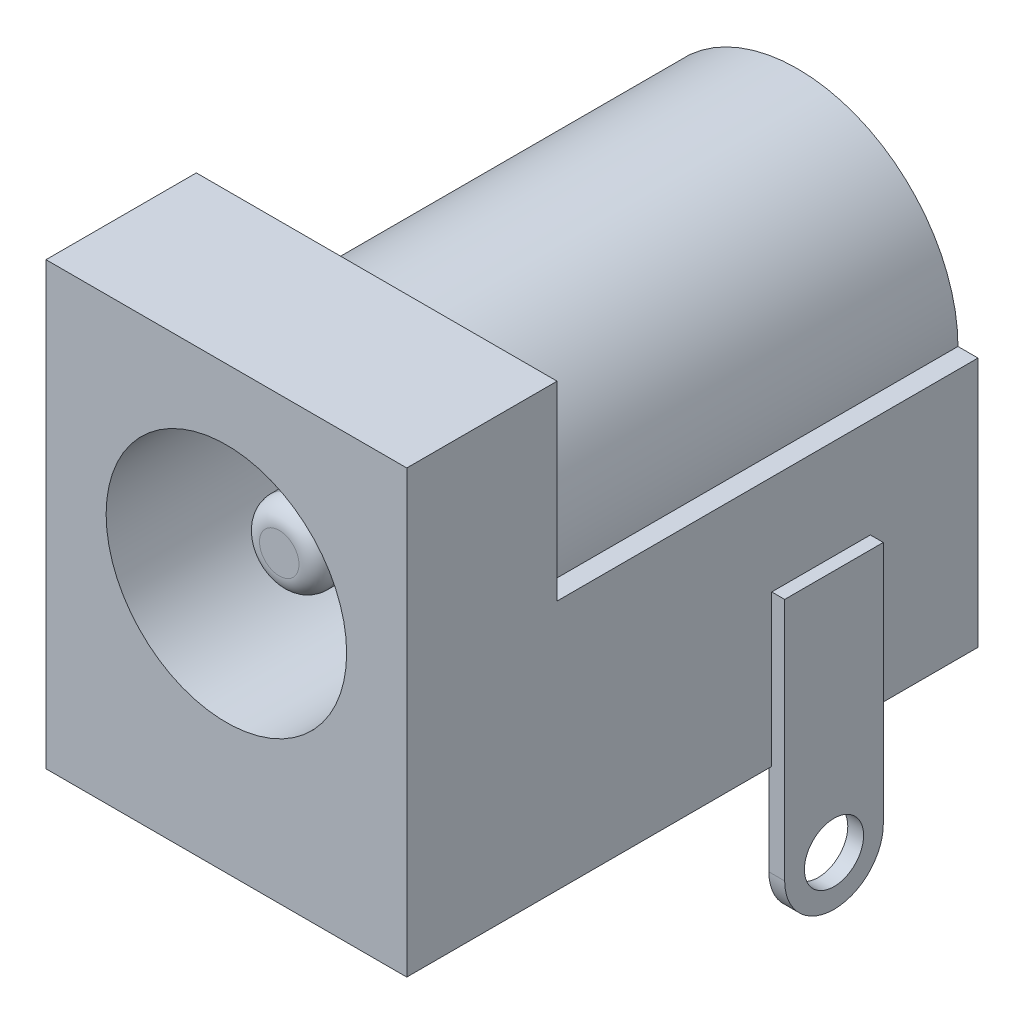
ISO-10303-21;
HEADER;
FILE_DESCRIPTION(('STEP AP214'),'2;1');
FILE_NAME('part.step','',(''),(''),'','','');
FILE_SCHEMA(('AUTOMOTIVE_DESIGN { 1 0 10303 214 1 1 1 1 }'));
ENDSEC;
DATA;
#1=APPLICATION_CONTEXT('core data for automotive mechanical design processes');
#2=APPLICATION_PROTOCOL_DEFINITION('international standard','automotive_design',2000,#1);
#3=PRODUCT_CONTEXT('',#1,'mechanical');
#4=PRODUCT('Part','Part','',(#3));
#5=PRODUCT_RELATED_PRODUCT_CATEGORY('part','',(#4));
#6=PRODUCT_DEFINITION_FORMATION('','',#4);
#7=PRODUCT_DEFINITION_CONTEXT('part definition',#1,'design');
#8=PRODUCT_DEFINITION('design','',#6,#7);
#9=PRODUCT_DEFINITION_SHAPE('','',#8);
#10=(LENGTH_UNIT() NAMED_UNIT(*) SI_UNIT(.MILLI.,.METRE.));
#11=(NAMED_UNIT(*) PLANE_ANGLE_UNIT() SI_UNIT($,.RADIAN.));
#12=(NAMED_UNIT(*) SI_UNIT($,.STERADIAN.) SOLID_ANGLE_UNIT());
#13=UNCERTAINTY_MEASURE_WITH_UNIT(LENGTH_MEASURE(1.E-05),#10,'distance_accuracy_value','');
#14=(GEOMETRIC_REPRESENTATION_CONTEXT(3) GLOBAL_UNCERTAINTY_ASSIGNED_CONTEXT((#13)) GLOBAL_UNIT_ASSIGNED_CONTEXT((#10,
#11,#12)) REPRESENTATION_CONTEXT('',''));
#15=CARTESIAN_POINT('',(0.,0.,0.));
#16=DIRECTION('',(0.,0.,1.));
#17=DIRECTION('',(1.,0.,0.));
#18=AXIS2_PLACEMENT_3D('',#15,#16,#17);
#19=CARTESIAN_POINT('',(-4.572,0.,-3.81));
#20=DIRECTION('',(0.,-1.,0.));
#21=DIRECTION('',(1.,0.,0.));
#22=AXIS2_PLACEMENT_3D('',#19,#20,#21);
#23=PLANE('',#22);
#24=DIRECTION('',(-1.,0.,0.));
#25=VECTOR('',#24,1.);
#26=CARTESIAN_POINT('',(-1.1,0.,-7.65));
#27=LINE('',#26,#25);
#28=CARTESIAN_POINT('',(1.1,0.,-7.65));
#29=VERTEX_POINT('',#28);
#30=CARTESIAN_POINT('',(-1.1,0.,-7.65));
#31=VERTEX_POINT('',#30);
#32=EDGE_CURVE('E55',#29,#31,#27,.T.);
#33=ORIENTED_EDGE('',*,*,#32,.T.);
#34=DIRECTION('',(0.,0.,-1.));
#35=VECTOR('',#34,1.);
#36=CARTESIAN_POINT('',(-1.1,0.,-7.35));
#37=LINE('',#36,#35);
#38=CARTESIAN_POINT('',(-1.1,0.,-7.35));
#39=VERTEX_POINT('',#38);
#40=EDGE_CURVE('E241',#39,#31,#37,.T.);
#41=ORIENTED_EDGE('',*,*,#40,.F.);
#42=DIRECTION('',(-1.,0.,0.));
#43=VECTOR('',#42,1.);
#44=CARTESIAN_POINT('',(-1.1,0.,-7.35));
#45=LINE('',#44,#43);
#46=CARTESIAN_POINT('',(1.1,0.,-7.35));
#47=VERTEX_POINT('',#46);
#48=EDGE_CURVE('E216',#47,#39,#45,.T.);
#49=ORIENTED_EDGE('',*,*,#48,.F.);
#50=DIRECTION('',(0.,0.,-1.));
#51=VECTOR('',#50,1.);
#52=CARTESIAN_POINT('',(1.1,0.,-7.35));
#53=LINE('',#52,#51);
#54=EDGE_CURVE('E226',#47,#29,#53,.T.);
#55=ORIENTED_EDGE('',*,*,#54,.T.);
#56=EDGE_LOOP('',(#33,#41,#49,#55));
#57=FACE_BOUND('',#56,.T.);
#58=DIRECTION('',(0.,0.,-1.));
#59=VECTOR('',#58,1.);
#60=CARTESIAN_POINT('',(4.5,0.,-3.81));
#61=LINE('',#60,#59);
#62=CARTESIAN_POINT('',(4.5,0.,-9.2499999999999));
#63=VERTEX_POINT('',#62);
#64=CARTESIAN_POINT('',(4.5,0.,-11.7499999999999));
#65=VERTEX_POINT('',#64);
#66=EDGE_CURVE('E348',#63,#65,#61,.T.);
#67=ORIENTED_EDGE('',*,*,#66,.F.);
#68=DIRECTION('',(1.,0.,0.));
#69=VECTOR('',#68,1.);
#70=CARTESIAN_POINT('',(-4.572,0.,-9.2499999999999));
#71=LINE('',#70,#69);
#72=CARTESIAN_POINT('',(4.572,0.,-9.2499999999999));
#73=VERTEX_POINT('',#72);
#74=EDGE_CURVE('E40',#63,#73,#71,.T.);
#75=ORIENTED_EDGE('',*,*,#74,.T.);
#76=DIRECTION('',(0.,0.,1.));
#77=VECTOR('',#76,1.);
#78=CARTESIAN_POINT('',(4.572,0.,-3.81));
#79=LINE('',#78,#77);
#80=CARTESIAN_POINT('',(4.572,0.,0.));
#81=VERTEX_POINT('',#80);
#82=EDGE_CURVE('E355',#73,#81,#79,.T.);
#83=ORIENTED_EDGE('',*,*,#82,.T.);
#84=DIRECTION('',(1.,0.,0.));
#85=VECTOR('',#84,1.);
#86=CARTESIAN_POINT('',(-4.572,0.,0.));
#87=LINE('',#86,#85);
#88=CARTESIAN_POINT('',(-4.572,0.,0.));
#89=VERTEX_POINT('',#88);
#90=EDGE_CURVE('E385',#89,#81,#87,.T.);
#91=ORIENTED_EDGE('',*,*,#90,.F.);
#92=DIRECTION('',(0.,0.,1.));
#93=VECTOR('',#92,1.);
#94=CARTESIAN_POINT('',(-4.572,0.,-3.81));
#95=LINE('',#94,#93);
#96=CARTESIAN_POINT('',(-4.572,0.,-14.478));
#97=VERTEX_POINT('',#96);
#98=EDGE_CURVE('E365',#97,#89,#95,.T.);
#99=ORIENTED_EDGE('',*,*,#98,.F.);
#100=DIRECTION('',(-1.,0.,0.));
#101=VECTOR('',#100,1.);
#102=CARTESIAN_POINT('',(-4.572,0.,-14.478));
#103=LINE('',#102,#101);
#104=CARTESIAN_POINT('',(4.572,0.,-14.478));
#105=VERTEX_POINT('',#104);
#106=EDGE_CURVE('E302',#105,#97,#103,.T.);
#107=ORIENTED_EDGE('',*,*,#106,.F.);
#108=CARTESIAN_POINT('',(4.572,0.,-11.7499999999999));
#109=VERTEX_POINT('',#108);
#110=EDGE_CURVE('E364',#105,#109,#79,.T.);
#111=ORIENTED_EDGE('',*,*,#110,.T.);
#112=DIRECTION('',(-1.,0.,0.));
#113=VECTOR('',#112,1.);
#114=CARTESIAN_POINT('',(-4.572,0.,-11.7499999999999));
#115=LINE('',#114,#113);
#116=EDGE_CURVE('E345',#109,#65,#115,.T.);
#117=ORIENTED_EDGE('',*,*,#116,.T.);
#118=EDGE_LOOP('',(#67,#75,#83,#91,#99,#107,#111,#117));
#119=FACE_BOUND('',#118,.T.);
#120=DIRECTION('',(-1.,0.,0.));
#121=VECTOR('',#120,1.);
#122=CARTESIAN_POINT('',(1.425,0.,-13.9));
#123=LINE('',#122,#121);
#124=CARTESIAN_POINT('',(1.425,0.,-13.9));
#125=VERTEX_POINT('',#124);
#126=CARTESIAN_POINT('',(-1.425,0.,-13.9));
#127=VERTEX_POINT('',#126);
#128=EDGE_CURVE('E47',#125,#127,#123,.T.);
#129=ORIENTED_EDGE('',*,*,#128,.T.);
#130=DIRECTION('',(0.,0.,-1.));
#131=VECTOR('',#130,1.);
#132=CARTESIAN_POINT('',(-1.425,0.,-13.5));
#133=LINE('',#132,#131);
#134=CARTESIAN_POINT('',(-1.425,0.,-13.5));
#135=VERTEX_POINT('',#134);
#136=EDGE_CURVE('E187',#135,#127,#133,.T.);
#137=ORIENTED_EDGE('',*,*,#136,.F.);
#138=DIRECTION('',(-1.,0.,0.));
#139=VECTOR('',#138,1.);
#140=CARTESIAN_POINT('',(1.425,0.,-13.5));
#141=LINE('',#140,#139);
#142=CARTESIAN_POINT('',(1.425,0.,-13.5));
#143=VERTEX_POINT('',#142);
#144=EDGE_CURVE('E193',#143,#135,#141,.T.);
#145=ORIENTED_EDGE('',*,*,#144,.F.);
#146=DIRECTION('',(0.,0.,-1.));
#147=VECTOR('',#146,1.);
#148=CARTESIAN_POINT('',(1.425,0.,-13.5));
#149=LINE('',#148,#147);
#150=EDGE_CURVE('E694',#143,#125,#149,.T.);
#151=ORIENTED_EDGE('',*,*,#150,.T.);
#152=EDGE_LOOP('',(#129,#137,#145,#151));
#153=FACE_BOUND('',#152,.T.);
#154=ADVANCED_FACE('F32',(#57,#119,#153),#23,.T.);
#155=CARTESIAN_POINT('',(4.572,0.,-3.81));
#156=DIRECTION('',(1.,0.,0.));
#157=DIRECTION('',(0.,0.,-1.));
#158=AXIS2_PLACEMENT_3D('',#155,#156,#157);
#159=PLANE('',#158);
#160=ORIENTED_EDGE('',*,*,#82,.F.);
#161=DIRECTION('',(0.,1.,0.));
#162=VECTOR('',#161,1.);
#163=CARTESIAN_POINT('',(4.572,0.,-9.2499999999999));
#164=LINE('',#163,#162);
#165=CARTESIAN_POINT('',(4.572,3.8299999999999,-9.2499999999999));
#166=VERTEX_POINT('',#165);
#167=EDGE_CURVE('E280',#73,#166,#164,.T.);
#168=ORIENTED_EDGE('',*,*,#167,.T.);
#169=DIRECTION('',(0.,0.,-1.));
#170=VECTOR('',#169,1.);
#171=CARTESIAN_POINT('',(4.572,3.8299999999999,-3.81));
#172=LINE('',#171,#170);
#173=CARTESIAN_POINT('',(4.572,3.8299999999999,-11.7499999999999));
#174=VERTEX_POINT('',#173);
#175=EDGE_CURVE('E12',#166,#174,#172,.T.);
#176=ORIENTED_EDGE('',*,*,#175,.T.);
#177=DIRECTION('',(0.,-1.,0.));
#178=VECTOR('',#177,1.);
#179=CARTESIAN_POINT('',(4.572,0.,-11.7499999999999));
#180=LINE('',#179,#178);
#181=EDGE_CURVE('E277',#174,#109,#180,.T.);
#182=ORIENTED_EDGE('',*,*,#181,.T.);
#183=ORIENTED_EDGE('',*,*,#110,.F.);
#184=DIRECTION('',(0.,-1.,0.));
#185=VECTOR('',#184,1.);
#186=CARTESIAN_POINT('',(4.572,0.,-14.478));
#187=LINE('',#186,#185);
#188=CARTESIAN_POINT('',(4.57200000000001,6.34999999999998,-14.478));
#189=VERTEX_POINT('',#188);
#190=EDGE_CURVE('E299',#189,#105,#187,.T.);
#191=ORIENTED_EDGE('',*,*,#190,.F.);
#192=DIRECTION('',(0.,0.,1.));
#193=VECTOR('',#192,1.);
#194=CARTESIAN_POINT('',(4.57200000000001,6.34999999999998,-14.478));
#195=LINE('',#194,#193);
#196=CARTESIAN_POINT('',(4.57200000000001,6.34999999999998,-3.81));
#197=VERTEX_POINT('',#196);
#198=EDGE_CURVE('E323',#189,#197,#195,.T.);
#199=ORIENTED_EDGE('',*,*,#198,.T.);
#200=DIRECTION('',(0.,1.,0.));
#201=VECTOR('',#200,1.);
#202=CARTESIAN_POINT('',(4.572,0.,-3.81));
#203=LINE('',#202,#201);
#204=CARTESIAN_POINT('',(4.572,11.176,-3.81));
#205=VERTEX_POINT('',#204);
#206=EDGE_CURVE('E320',#197,#205,#203,.T.);
#207=ORIENTED_EDGE('',*,*,#206,.T.);
#208=DIRECTION('',(0.,0.,1.));
#209=VECTOR('',#208,1.);
#210=CARTESIAN_POINT('',(4.572,11.176,-3.81));
#211=LINE('',#210,#209);
#212=CARTESIAN_POINT('',(4.572,11.176,0.));
#213=VERTEX_POINT('',#212);
#214=EDGE_CURVE('E368',#205,#213,#211,.T.);
#215=ORIENTED_EDGE('',*,*,#214,.T.);
#216=DIRECTION('',(0.,1.,0.));
#217=VECTOR('',#216,1.);
#218=CARTESIAN_POINT('',(4.572,0.,0.));
#219=LINE('',#218,#217);
#220=EDGE_CURVE('E362',#81,#213,#219,.T.);
#221=ORIENTED_EDGE('',*,*,#220,.F.);
#222=EDGE_LOOP('',(#160,#168,#176,#182,#183,#191,#199,#207,#215,#221));
#223=FACE_BOUND('',#222,.T.);
#224=ADVANCED_FACE('F360',(#223),#159,.T.);
#225=CARTESIAN_POINT('',(0.,6.35,-9.144));
#226=DIRECTION('',(0.,0.,1.));
#227=DIRECTION('',(1.,0.,0.));
#228=AXIS2_PLACEMENT_3D('',#225,#226,#227);
#229=PLANE('',#228);
#230=CARTESIAN_POINT('',(0.,6.35,-9.144));
#231=DIRECTION('',(0.,0.,1.));
#232=DIRECTION('',(1.,0.,0.));
#233=AXIS2_PLACEMENT_3D('',#230,#231,#232);
#234=CIRCLE('',#233,3.048);
#235=CARTESIAN_POINT('',(3.048,6.35,-9.144));
#236=VERTEX_POINT('',#235);
#237=EDGE_CURVE('E287',#236,#236,#234,.T.);
#238=ORIENTED_EDGE('',*,*,#237,.T.);
#239=EDGE_LOOP('',(#238));
#240=FACE_BOUND('',#239,.T.);
#241=CARTESIAN_POINT('',(0.,6.35,-9.144));
#242=DIRECTION('',(0.,0.,1.));
#243=DIRECTION('',(1.,0.,0.));
#244=AXIS2_PLACEMENT_3D('',#241,#242,#243);
#245=CIRCLE('',#244,0.999999999999999);
#246=CARTESIAN_POINT('',(0.999999999999999,6.35,-9.144));
#247=VERTEX_POINT('',#246);
#248=EDGE_CURVE('E283',#247,#247,#245,.T.);
#249=ORIENTED_EDGE('',*,*,#248,.F.);
#250=EDGE_LOOP('',(#249));
#251=FACE_BOUND('',#250,.T.);
#252=ADVANCED_FACE('F407',(#240,#251),#229,.T.);
#253=CARTESIAN_POINT('',(-4.572,0.,-3.81));
#254=DIRECTION('',(-1.,0.,0.));
#255=DIRECTION('',(0.,-1.,0.));
#256=AXIS2_PLACEMENT_3D('',#253,#254,#255);
#257=PLANE('',#256);
#258=DIRECTION('',(0.,-1.,0.));
#259=VECTOR('',#258,1.);
#260=CARTESIAN_POINT('',(-4.572,0.,0.));
#261=LINE('',#260,#259);
#262=CARTESIAN_POINT('',(-4.572,11.176,0.));
#263=VERTEX_POINT('',#262);
#264=EDGE_CURVE('E382',#263,#89,#261,.T.);
#265=ORIENTED_EDGE('',*,*,#264,.F.);
#266=DIRECTION('',(0.,0.,1.));
#267=VECTOR('',#266,1.);
#268=CARTESIAN_POINT('',(-4.572,11.176,-3.81));
#269=LINE('',#268,#267);
#270=CARTESIAN_POINT('',(-4.572,11.176,-3.81));
#271=VERTEX_POINT('',#270);
#272=EDGE_CURVE('E342',#271,#263,#269,.T.);
#273=ORIENTED_EDGE('',*,*,#272,.F.);
#274=DIRECTION('',(0.,-1.,0.));
#275=VECTOR('',#274,1.);
#276=CARTESIAN_POINT('',(-4.572,0.,-3.81));
#277=LINE('',#276,#275);
#278=CARTESIAN_POINT('',(-4.572,6.34999999999998,-3.81));
#279=VERTEX_POINT('',#278);
#280=EDGE_CURVE('E373',#271,#279,#277,.T.);
#281=ORIENTED_EDGE('',*,*,#280,.T.);
#282=DIRECTION('',(0.,0.,1.));
#283=VECTOR('',#282,1.);
#284=CARTESIAN_POINT('',(-4.57200000000001,6.34999999999997,-14.478));
#285=LINE('',#284,#283);
#286=CARTESIAN_POINT('',(-4.57200000000001,6.34999999999997,-14.478));
#287=VERTEX_POINT('',#286);
#288=EDGE_CURVE('E327',#287,#279,#285,.T.);
#289=ORIENTED_EDGE('',*,*,#288,.F.);
#290=DIRECTION('',(0.,1.,0.));
#291=VECTOR('',#290,1.);
#292=CARTESIAN_POINT('',(-4.57200000000001,6.34999999999997,-14.478));
#293=LINE('',#292,#291);
#294=EDGE_CURVE('E305',#97,#287,#293,.T.);
#295=ORIENTED_EDGE('',*,*,#294,.F.);
#296=ORIENTED_EDGE('',*,*,#98,.T.);
#297=EDGE_LOOP('',(#265,#273,#281,#289,#295,#296));
#298=FACE_BOUND('',#297,.T.);
#299=ADVANCED_FACE('F399',(#298),#257,.T.);
#300=CARTESIAN_POINT('',(-4.572,11.176,-3.81));
#301=DIRECTION('',(0.,1.,0.));
#302=DIRECTION('',(-1.,0.,0.));
#303=AXIS2_PLACEMENT_3D('',#300,#301,#302);
#304=PLANE('',#303);
#305=DIRECTION('',(-1.,0.,0.));
#306=VECTOR('',#305,1.);
#307=CARTESIAN_POINT('',(-4.572,11.176,0.));
#308=LINE('',#307,#306);
#309=EDGE_CURVE('E376',#213,#263,#308,.T.);
#310=ORIENTED_EDGE('',*,*,#309,.F.);
#311=ORIENTED_EDGE('',*,*,#214,.F.);
#312=DIRECTION('',(-1.,0.,0.));
#313=VECTOR('',#312,1.);
#314=CARTESIAN_POINT('',(-4.572,11.176,-3.81));
#315=LINE('',#314,#313);
#316=EDGE_CURVE('E369',#205,#271,#315,.T.);
#317=ORIENTED_EDGE('',*,*,#316,.T.);
#318=ORIENTED_EDGE('',*,*,#272,.T.);
#319=EDGE_LOOP('',(#310,#311,#317,#318));
#320=FACE_BOUND('',#319,.T.);
#321=ADVANCED_FACE('F396',(#320),#304,.T.);
#322=CARTESIAN_POINT('',(-4.572,11.176,-3.81));
#323=DIRECTION('',(0.,0.,-1.));
#324=DIRECTION('',(-1.,0.,0.));
#325=AXIS2_PLACEMENT_3D('',#322,#323,#324);
#326=PLANE('',#325);
#327=DIRECTION('',(1.,0.,0.));
#328=VECTOR('',#327,1.);
#329=CARTESIAN_POINT('',(-4.064,6.35,-3.81));
#330=LINE('',#329,#328);
#331=CARTESIAN_POINT('',(-4.064,6.35,-3.81));
#332=VERTEX_POINT('',#331);
#333=EDGE_CURVE('E297',#279,#332,#330,.T.);
#334=ORIENTED_EDGE('',*,*,#333,.F.);
#335=ORIENTED_EDGE('',*,*,#280,.F.);
#336=ORIENTED_EDGE('',*,*,#316,.F.);
#337=ORIENTED_EDGE('',*,*,#206,.F.);
#338=DIRECTION('',(1.,0.,0.));
#339=VECTOR('',#338,1.);
#340=CARTESIAN_POINT('',(4.064,6.35,-3.81));
#341=LINE('',#340,#339);
#342=CARTESIAN_POINT('',(4.064,6.35,-3.81));
#343=VERTEX_POINT('',#342);
#344=EDGE_CURVE('E312',#343,#197,#341,.T.);
#345=ORIENTED_EDGE('',*,*,#344,.F.);
#346=CARTESIAN_POINT('',(0.,6.35,-3.81));
#347=DIRECTION('',(0.,0.,-1.));
#348=DIRECTION('',(1.,0.,0.));
#349=AXIS2_PLACEMENT_3D('',#346,#347,#348);
#350=CIRCLE('',#349,4.064);
#351=EDGE_CURVE('E290',#332,#343,#350,.T.);
#352=ORIENTED_EDGE('',*,*,#351,.F.);
#353=EDGE_LOOP('',(#334,#335,#336,#337,#345,#352));
#354=FACE_BOUND('',#353,.T.);
#355=ADVANCED_FACE('F398',(#354),#326,.T.);
#356=CARTESIAN_POINT('',(-4.572,11.176,0.));
#357=DIRECTION('',(0.,0.,-1.));
#358=DIRECTION('',(-1.,0.,0.));
#359=AXIS2_PLACEMENT_3D('',#356,#357,#358);
#360=PLANE('',#359);
#361=CARTESIAN_POINT('',(0.,6.35,0.));
#362=DIRECTION('',(0.,0.,1.));
#363=DIRECTION('',(1.,0.,0.));
#364=AXIS2_PLACEMENT_3D('',#361,#362,#363);
#365=CIRCLE('',#364,3.048);
#366=CARTESIAN_POINT('',(3.048,6.35,0.));
#367=VERTEX_POINT('',#366);
#368=EDGE_CURVE('E286',#367,#367,#365,.T.);
#369=ORIENTED_EDGE('',*,*,#368,.F.);
#370=EDGE_LOOP('',(#369));
#371=FACE_BOUND('',#370,.T.);
#372=ORIENTED_EDGE('',*,*,#264,.T.);
#373=ORIENTED_EDGE('',*,*,#90,.T.);
#374=ORIENTED_EDGE('',*,*,#220,.T.);
#375=ORIENTED_EDGE('',*,*,#309,.T.);
#376=EDGE_LOOP('',(#372,#373,#374,#375));
#377=FACE_BOUND('',#376,.T.);
#378=ADVANCED_FACE('F395',(#371,#377),#360,.F.);
#379=CARTESIAN_POINT('',(0.,6.35,-14.478));
#380=DIRECTION('',(0.,0.,1.));
#381=DIRECTION('',(1.,0.,0.));
#382=AXIS2_PLACEMENT_3D('',#379,#380,#381);
#383=CYLINDRICAL_SURFACE('',#382,4.064);
#384=ORIENTED_EDGE('',*,*,#351,.T.);
#385=DIRECTION('',(0.,0.,1.));
#386=VECTOR('',#385,1.);
#387=CARTESIAN_POINT('',(4.064,6.35,-14.478));
#388=LINE('',#387,#386);
#389=CARTESIAN_POINT('',(4.064,6.35,-14.478));
#390=VERTEX_POINT('',#389);
#391=EDGE_CURVE('E326',#390,#343,#388,.T.);
#392=ORIENTED_EDGE('',*,*,#391,.F.);
#393=CARTESIAN_POINT('',(0.,6.35,-14.478));
#394=DIRECTION('',(0.,0.,-1.));
#395=DIRECTION('',(1.,0.,0.));
#396=AXIS2_PLACEMENT_3D('',#393,#394,#395);
#397=CIRCLE('',#396,4.064);
#398=CARTESIAN_POINT('',(-4.064,6.35,-14.478));
#399=VERTEX_POINT('',#398);
#400=EDGE_CURVE('E293',#399,#390,#397,.T.);
#401=ORIENTED_EDGE('',*,*,#400,.F.);
#402=DIRECTION('',(0.,0.,1.));
#403=VECTOR('',#402,1.);
#404=CARTESIAN_POINT('',(-4.064,6.35,-14.478));
#405=LINE('',#404,#403);
#406=EDGE_CURVE('E309',#399,#332,#405,.T.);
#407=ORIENTED_EDGE('',*,*,#406,.T.);
#408=EDGE_LOOP('',(#384,#392,#401,#407));
#409=FACE_BOUND('',#408,.T.);
#410=ADVANCED_FACE('F509',(#409),#383,.T.);
#411=CARTESIAN_POINT('',(4.064,6.35,-14.478));
#412=DIRECTION('',(0.,-1.,0.));
#413=DIRECTION('',(1.,0.,0.));
#414=AXIS2_PLACEMENT_3D('',#411,#412,#413);
#415=PLANE('',#414);
#416=ORIENTED_EDGE('',*,*,#344,.T.);
#417=ORIENTED_EDGE('',*,*,#198,.F.);
#418=DIRECTION('',(1.,0.,0.));
#419=VECTOR('',#418,1.);
#420=CARTESIAN_POINT('',(4.064,6.35,-14.478));
#421=LINE('',#420,#419);
#422=EDGE_CURVE('E296',#390,#189,#421,.T.);
#423=ORIENTED_EDGE('',*,*,#422,.F.);
#424=ORIENTED_EDGE('',*,*,#391,.T.);
#425=EDGE_LOOP('',(#416,#417,#423,#424));
#426=FACE_BOUND('',#425,.T.);
#427=ADVANCED_FACE('F505',(#426),#415,.F.);
#428=CARTESIAN_POINT('',(-4.064,6.35,-14.478));
#429=DIRECTION('',(0.,-1.,0.));
#430=DIRECTION('',(1.,0.,0.));
#431=AXIS2_PLACEMENT_3D('',#428,#429,#430);
#432=PLANE('',#431);
#433=ORIENTED_EDGE('',*,*,#333,.T.);
#434=ORIENTED_EDGE('',*,*,#406,.F.);
#435=DIRECTION('',(1.,0.,0.));
#436=VECTOR('',#435,1.);
#437=CARTESIAN_POINT('',(-4.064,6.35,-14.478));
#438=LINE('',#437,#436);
#439=EDGE_CURVE('E307',#287,#399,#438,.T.);
#440=ORIENTED_EDGE('',*,*,#439,.F.);
#441=ORIENTED_EDGE('',*,*,#288,.T.);
#442=EDGE_LOOP('',(#433,#434,#440,#441));
#443=FACE_BOUND('',#442,.T.);
#444=ADVANCED_FACE('F501',(#443),#432,.F.);
#445=CARTESIAN_POINT('',(0.,6.35,-14.478));
#446=DIRECTION('',(0.,0.,1.));
#447=DIRECTION('',(1.,0.,0.));
#448=AXIS2_PLACEMENT_3D('',#445,#446,#447);
#449=PLANE('',#448);
#450=ORIENTED_EDGE('',*,*,#400,.T.);
#451=ORIENTED_EDGE('',*,*,#422,.T.);
#452=ORIENTED_EDGE('',*,*,#190,.T.);
#453=ORIENTED_EDGE('',*,*,#106,.T.);
#454=ORIENTED_EDGE('',*,*,#294,.T.);
#455=ORIENTED_EDGE('',*,*,#439,.T.);
#456=EDGE_LOOP('',(#450,#451,#452,#453,#454,#455));
#457=FACE_BOUND('',#456,.T.);
#458=ADVANCED_FACE('F497',(#457),#449,.F.);
#459=CARTESIAN_POINT('',(0.,6.35,-9.144));
#460=DIRECTION('',(0.,0.,1.));
#461=DIRECTION('',(1.,0.,0.));
#462=AXIS2_PLACEMENT_3D('',#459,#460,#461);
#463=CYLINDRICAL_SURFACE('',#462,3.048);
#464=ORIENTED_EDGE('',*,*,#237,.F.);
#465=EDGE_LOOP('',(#464));
#466=FACE_BOUND('',#465,.T.);
#467=ORIENTED_EDGE('',*,*,#368,.T.);
#468=EDGE_LOOP('',(#467));
#469=FACE_BOUND('',#468,.T.);
#470=ADVANCED_FACE('F490',(#466,#469),#463,.F.);
#471=CARTESIAN_POINT('',(0.,6.35,2.82842712474619));
#472=DIRECTION('',(0.,0.,-1.));
#473=DIRECTION('',(-1.,0.,0.));
#474=AXIS2_PLACEMENT_3D('',#471,#472,#473);
#475=CYLINDRICAL_SURFACE('',#474,0.999999999999999);
#476=CARTESIAN_POINT('',(0.,6.35,-1.84));
#477=DIRECTION('',(0.,0.,-1.));
#478=DIRECTION('',(-1.,0.,0.));
#479=AXIS2_PLACEMENT_3D('',#476,#477,#478);
#480=CIRCLE('',#479,0.999999999999999);
#481=CARTESIAN_POINT('',(-0.999999999999999,6.35,-1.84));
#482=VERTEX_POINT('',#481);
#483=EDGE_CURVE('E338',#482,#482,#480,.T.);
#484=ORIENTED_EDGE('',*,*,#483,.T.);
#485=EDGE_LOOP('',(#484));
#486=FACE_BOUND('',#485,.T.);
#487=ORIENTED_EDGE('',*,*,#248,.T.);
#488=EDGE_LOOP('',(#487));
#489=FACE_BOUND('',#488,.T.);
#490=ADVANCED_FACE('F486',(#486,#489),#475,.T.);
#491=CARTESIAN_POINT('',(-4.572,11.176,-1.34));
#492=DIRECTION('',(0.,0.,-1.));
#493=DIRECTION('',(-1.,0.,0.));
#494=AXIS2_PLACEMENT_3D('',#491,#492,#493);
#495=PLANE('',#494);
#496=CARTESIAN_POINT('',(0.,6.35,-1.34));
#497=DIRECTION('',(0.,0.,-1.));
#498=DIRECTION('',(-1.,0.,0.));
#499=AXIS2_PLACEMENT_3D('',#496,#497,#498);
#500=CIRCLE('',#499,0.499999999999999);
#501=CARTESIAN_POINT('',(-0.499999999999999,6.35,-1.34));
#502=VERTEX_POINT('',#501);
#503=EDGE_CURVE('E341',#502,#502,#500,.F.);
#504=ORIENTED_EDGE('',*,*,#503,.T.);
#505=EDGE_LOOP('',(#504));
#506=FACE_BOUND('',#505,.T.);
#507=ADVANCED_FACE('F483',(#506),#495,.F.);
#508=CARTESIAN_POINT('',(0.,6.35,-1.84));
#509=DIRECTION('',(0.,0.,-1.));
#510=DIRECTION('',(-1.,0.,0.));
#511=AXIS2_PLACEMENT_3D('',#508,#509,#510);
#512=DEGENERATE_TOROIDAL_SURFACE('',#511,0.499999999999999,0.5,.T.);
#513=ORIENTED_EDGE('',*,*,#503,.F.);
#514=EDGE_LOOP('',(#513));
#515=FACE_BOUND('',#514,.T.);
#516=ORIENTED_EDGE('',*,*,#483,.F.);
#517=EDGE_LOOP('',(#516));
#518=FACE_BOUND('',#517,.T.);
#519=ADVANCED_FACE('F34',(#515,#518),#512,.T.);
#520=CARTESIAN_POINT('',(4.9,-2.35000000000015,-10.4999999999999));
#521=DIRECTION('',(-1.,0.,0.));
#522=DIRECTION('',(0.,0.,1.));
#523=AXIS2_PLACEMENT_3D('',#520,#521,#522);
#524=PLANE('',#523);
#525=DIRECTION('',(0.,0.,1.));
#526=VECTOR('',#525,1.);
#527=CARTESIAN_POINT('',(4.9,3.8299999999999,-9.2499999999999));
#528=LINE('',#527,#526);
#529=CARTESIAN_POINT('',(4.9,3.8299999999999,-11.7499999999999));
#530=VERTEX_POINT('',#529);
#531=CARTESIAN_POINT('',(4.9,3.8299999999999,-9.2499999999999));
#532=VERTEX_POINT('',#531);
#533=EDGE_CURVE('E251',#530,#532,#528,.T.);
#534=ORIENTED_EDGE('',*,*,#533,.T.);
#535=DIRECTION('',(0.,-1.,0.));
#536=VECTOR('',#535,1.);
#537=CARTESIAN_POINT('',(4.9,3.8299999999999,-9.2499999999999));
#538=LINE('',#537,#536);
#539=CARTESIAN_POINT('',(4.9,-2.35000000000015,-9.2499999999999));
#540=VERTEX_POINT('',#539);
#541=EDGE_CURVE('E254',#532,#540,#538,.T.);
#542=ORIENTED_EDGE('',*,*,#541,.T.);
#543=CARTESIAN_POINT('',(4.9,-2.35000000000015,-10.4999999999999));
#544=DIRECTION('',(1.,0.,0.));
#545=DIRECTION('',(0.,0.,1.));
#546=AXIS2_PLACEMENT_3D('',#543,#544,#545);
#547=CIRCLE('',#546,1.25);
#548=CARTESIAN_POINT('',(4.9,-2.35000000000015,-11.7499999999999));
#549=VERTEX_POINT('',#548);
#550=EDGE_CURVE('E257',#540,#549,#547,.T.);
#551=ORIENTED_EDGE('',*,*,#550,.T.);
#552=DIRECTION('',(0.,1.,0.));
#553=VECTOR('',#552,1.);
#554=CARTESIAN_POINT('',(4.9,3.8299999999999,-11.7499999999999));
#555=LINE('',#554,#553);
#556=EDGE_CURVE('E259',#549,#530,#555,.T.);
#557=ORIENTED_EDGE('',*,*,#556,.T.);
#558=EDGE_LOOP('',(#534,#542,#551,#557));
#559=FACE_BOUND('',#558,.T.);
#560=CARTESIAN_POINT('',(4.9,-2.35000000000015,-10.4999999999999));
#561=DIRECTION('',(1.,0.,0.));
#562=DIRECTION('',(0.,0.,-1.));
#563=AXIS2_PLACEMENT_3D('',#560,#561,#562);
#564=CIRCLE('',#563,0.75);
#565=CARTESIAN_POINT('',(4.9,-2.35000000000015,-11.2499999999999));
#566=VERTEX_POINT('',#565);
#567=EDGE_CURVE('E245',#566,#566,#564,.T.);
#568=ORIENTED_EDGE('',*,*,#567,.F.);
#569=EDGE_LOOP('',(#568));
#570=FACE_BOUND('',#569,.T.);
#571=ADVANCED_FACE('F461',(#559,#570),#524,.F.);
#572=CARTESIAN_POINT('',(4.5,-2.35000000000015,-10.4999999999999));
#573=DIRECTION('',(-1.,0.,0.));
#574=DIRECTION('',(0.,0.,1.));
#575=AXIS2_PLACEMENT_3D('',#572,#573,#574);
#576=PLANE('',#575);
#577=DIRECTION('',(0.,-1.,0.));
#578=VECTOR('',#577,1.);
#579=CARTESIAN_POINT('',(4.5,3.8299999999999,-9.2499999999999));
#580=LINE('',#579,#578);
#581=CARTESIAN_POINT('',(4.5,-2.35000000000015,-9.2499999999999));
#582=VERTEX_POINT('',#581);
#583=EDGE_CURVE('E248',#63,#582,#580,.T.);
#584=ORIENTED_EDGE('',*,*,#583,.F.);
#585=ORIENTED_EDGE('',*,*,#66,.T.);
#586=DIRECTION('',(0.,1.,0.));
#587=VECTOR('',#586,1.);
#588=CARTESIAN_POINT('',(4.5,3.8299999999999,-11.7499999999999));
#589=LINE('',#588,#587);
#590=CARTESIAN_POINT('',(4.5,-2.35000000000015,-11.7499999999999));
#591=VERTEX_POINT('',#590);
#592=EDGE_CURVE('E255',#591,#65,#589,.T.);
#593=ORIENTED_EDGE('',*,*,#592,.F.);
#594=CARTESIAN_POINT('',(4.5,-2.35000000000015,-10.4999999999999));
#595=DIRECTION('',(1.,0.,0.));
#596=DIRECTION('',(0.,0.,1.));
#597=AXIS2_PLACEMENT_3D('',#594,#595,#596);
#598=CIRCLE('',#597,1.25);
#599=EDGE_CURVE('E263',#582,#591,#598,.T.);
#600=ORIENTED_EDGE('',*,*,#599,.F.);
#601=EDGE_LOOP('',(#584,#585,#593,#600));
#602=FACE_BOUND('',#601,.T.);
#603=CARTESIAN_POINT('',(4.5,-2.35000000000015,-10.4999999999999));
#604=DIRECTION('',(1.,0.,0.));
#605=DIRECTION('',(0.,0.,-1.));
#606=AXIS2_PLACEMENT_3D('',#603,#604,#605);
#607=CIRCLE('',#606,0.75);
#608=CARTESIAN_POINT('',(4.5,-2.35000000000015,-11.2499999999999));
#609=VERTEX_POINT('',#608);
#610=EDGE_CURVE('E244',#609,#609,#607,.T.);
#611=ORIENTED_EDGE('',*,*,#610,.T.);
#612=EDGE_LOOP('',(#611));
#613=FACE_BOUND('',#612,.T.);
#614=ADVANCED_FACE('F464',(#602,#613),#576,.T.);
#615=CARTESIAN_POINT('',(4.9,3.8299999999999,-9.2499999999999));
#616=DIRECTION('',(0.,-1.,0.));
#617=DIRECTION('',(0.,0.,-1.));
#618=AXIS2_PLACEMENT_3D('',#615,#616,#617);
#619=PLANE('',#618);
#620=ORIENTED_EDGE('',*,*,#175,.F.);
#621=DIRECTION('',(-1.,0.,0.));
#622=VECTOR('',#621,1.);
#623=CARTESIAN_POINT('',(4.9,3.8299999999999,-9.2499999999999));
#624=LINE('',#623,#622);
#625=EDGE_CURVE('E274',#532,#166,#624,.T.);
#626=ORIENTED_EDGE('',*,*,#625,.F.);
#627=ORIENTED_EDGE('',*,*,#533,.F.);
#628=DIRECTION('',(-1.,0.,0.));
#629=VECTOR('',#628,1.);
#630=CARTESIAN_POINT('',(4.9,3.8299999999999,-11.7499999999999));
#631=LINE('',#630,#629);
#632=EDGE_CURVE('E261',#530,#174,#631,.T.);
#633=ORIENTED_EDGE('',*,*,#632,.T.);
#634=EDGE_LOOP('',(#620,#626,#627,#633));
#635=FACE_BOUND('',#634,.T.);
#636=ADVANCED_FACE('F468',(#635),#619,.F.);
#637=CARTESIAN_POINT('',(4.9,3.8299999999999,-9.2499999999999));
#638=DIRECTION('',(0.,0.,-1.));
#639=DIRECTION('',(0.,1.,0.));
#640=AXIS2_PLACEMENT_3D('',#637,#638,#639);
#641=PLANE('',#640);
#642=ORIENTED_EDGE('',*,*,#167,.F.);
#643=ORIENTED_EDGE('',*,*,#74,.F.);
#644=ORIENTED_EDGE('',*,*,#583,.T.);
#645=DIRECTION('',(-1.,0.,0.));
#646=VECTOR('',#645,1.);
#647=CARTESIAN_POINT('',(4.9,-2.35000000000015,-9.2499999999999));
#648=LINE('',#647,#646);
#649=EDGE_CURVE('E271',#540,#582,#648,.T.);
#650=ORIENTED_EDGE('',*,*,#649,.F.);
#651=ORIENTED_EDGE('',*,*,#541,.F.);
#652=ORIENTED_EDGE('',*,*,#625,.T.);
#653=EDGE_LOOP('',(#642,#643,#644,#650,#651,#652));
#654=FACE_BOUND('',#653,.T.);
#655=ADVANCED_FACE('F476',(#654),#641,.F.);
#656=CARTESIAN_POINT('',(4.9,-2.35000000000015,-10.4999999999999));
#657=DIRECTION('',(-1.,0.,0.));
#658=DIRECTION('',(0.,0.,1.));
#659=AXIS2_PLACEMENT_3D('',#656,#657,#658);
#660=CYLINDRICAL_SURFACE('',#659,1.25);
#661=ORIENTED_EDGE('',*,*,#599,.T.);
#662=DIRECTION('',(-1.,0.,0.));
#663=VECTOR('',#662,1.);
#664=CARTESIAN_POINT('',(4.9,-2.35000000000015,-11.7499999999999));
#665=LINE('',#664,#663);
#666=EDGE_CURVE('E268',#549,#591,#665,.T.);
#667=ORIENTED_EDGE('',*,*,#666,.F.);
#668=ORIENTED_EDGE('',*,*,#550,.F.);
#669=ORIENTED_EDGE('',*,*,#649,.T.);
#670=EDGE_LOOP('',(#661,#667,#668,#669));
#671=FACE_BOUND('',#670,.T.);
#672=ADVANCED_FACE('F472',(#671),#660,.T.);
#673=CARTESIAN_POINT('',(4.9,3.8299999999999,-11.7499999999999));
#674=DIRECTION('',(0.,0.,1.));
#675=DIRECTION('',(1.,0.,0.));
#676=AXIS2_PLACEMENT_3D('',#673,#674,#675);
#677=PLANE('',#676);
#678=ORIENTED_EDGE('',*,*,#181,.F.);
#679=ORIENTED_EDGE('',*,*,#632,.F.);
#680=ORIENTED_EDGE('',*,*,#556,.F.);
#681=ORIENTED_EDGE('',*,*,#666,.T.);
#682=ORIENTED_EDGE('',*,*,#592,.T.);
#683=ORIENTED_EDGE('',*,*,#116,.F.);
#684=EDGE_LOOP('',(#678,#679,#680,#681,#682,#683));
#685=FACE_BOUND('',#684,.T.);
#686=ADVANCED_FACE('F459',(#685),#677,.F.);
#687=CARTESIAN_POINT('',(4.9,-2.35000000000015,-10.4999999999999));
#688=DIRECTION('',(-1.,0.,0.));
#689=DIRECTION('',(0.,0.,1.));
#690=AXIS2_PLACEMENT_3D('',#687,#688,#689);
#691=CYLINDRICAL_SURFACE('',#690,0.75);
#692=ORIENTED_EDGE('',*,*,#567,.T.);
#693=EDGE_LOOP('',(#692));
#694=FACE_BOUND('',#693,.T.);
#695=ORIENTED_EDGE('',*,*,#610,.F.);
#696=EDGE_LOOP('',(#695));
#697=FACE_BOUND('',#696,.T.);
#698=ADVANCED_FACE('F437',(#694,#697),#691,.F.);
#699=CARTESIAN_POINT('',(0.,-2.5,-7.35));
#700=DIRECTION('',(0.,0.,1.));
#701=DIRECTION('',(1.,0.,0.));
#702=AXIS2_PLACEMENT_3D('',#699,#700,#701);
#703=PLANE('',#702);
#704=ORIENTED_EDGE('',*,*,#48,.T.);
#705=DIRECTION('',(0.,-1.,0.));
#706=VECTOR('',#705,1.);
#707=CARTESIAN_POINT('',(-1.1,0.,-7.35));
#708=LINE('',#707,#706);
#709=CARTESIAN_POINT('',(-1.1,-2.5,-7.35));
#710=VERTEX_POINT('',#709);
#711=EDGE_CURVE('E219',#39,#710,#708,.T.);
#712=ORIENTED_EDGE('',*,*,#711,.T.);
#713=CARTESIAN_POINT('',(0.,-2.5,-7.35));
#714=DIRECTION('',(0.,0.,1.));
#715=DIRECTION('',(1.,0.,0.));
#716=AXIS2_PLACEMENT_3D('',#713,#714,#715);
#717=CIRCLE('',#716,1.1);
#718=CARTESIAN_POINT('',(1.1,-2.5,-7.35));
#719=VERTEX_POINT('',#718);
#720=EDGE_CURVE('E222',#710,#719,#717,.T.);
#721=ORIENTED_EDGE('',*,*,#720,.T.);
#722=DIRECTION('',(0.,1.,0.));
#723=VECTOR('',#722,1.);
#724=CARTESIAN_POINT('',(1.1,0.,-7.35));
#725=LINE('',#724,#723);
#726=EDGE_CURVE('E224',#719,#47,#725,.T.);
#727=ORIENTED_EDGE('',*,*,#726,.T.);
#728=EDGE_LOOP('',(#704,#712,#721,#727));
#729=FACE_BOUND('',#728,.T.);
#730=CARTESIAN_POINT('',(0.,-2.5,-7.35));
#731=DIRECTION('',(0.,0.,1.));
#732=DIRECTION('',(1.,0.,0.));
#733=AXIS2_PLACEMENT_3D('',#730,#731,#732);
#734=CIRCLE('',#733,0.75);
#735=CARTESIAN_POINT('',(0.75,-2.5,-7.35));
#736=VERTEX_POINT('',#735);
#737=EDGE_CURVE('E208',#736,#736,#734,.T.);
#738=ORIENTED_EDGE('',*,*,#737,.F.);
#739=EDGE_LOOP('',(#738));
#740=FACE_BOUND('',#739,.T.);
#741=ADVANCED_FACE('F434',(#729,#740),#703,.T.);
#742=CARTESIAN_POINT('',(0.,-2.5,-7.65));
#743=DIRECTION('',(0.,0.,1.));
#744=DIRECTION('',(1.,0.,0.));
#745=AXIS2_PLACEMENT_3D('',#742,#743,#744);
#746=PLANE('',#745);
#747=ORIENTED_EDGE('',*,*,#32,.F.);
#748=DIRECTION('',(0.,1.,0.));
#749=VECTOR('',#748,1.);
#750=CARTESIAN_POINT('',(1.1,0.,-7.65));
#751=LINE('',#750,#749);
#752=CARTESIAN_POINT('',(1.1,-2.5,-7.65));
#753=VERTEX_POINT('',#752);
#754=EDGE_CURVE('E220',#753,#29,#751,.T.);
#755=ORIENTED_EDGE('',*,*,#754,.F.);
#756=CARTESIAN_POINT('',(0.,-2.5,-7.65));
#757=DIRECTION('',(0.,0.,1.));
#758=DIRECTION('',(1.,0.,0.));
#759=AXIS2_PLACEMENT_3D('',#756,#757,#758);
#760=CIRCLE('',#759,1.1);
#761=CARTESIAN_POINT('',(-1.1,-2.5,-7.65));
#762=VERTEX_POINT('',#761);
#763=EDGE_CURVE('E230',#762,#753,#760,.T.);
#764=ORIENTED_EDGE('',*,*,#763,.F.);
#765=DIRECTION('',(0.,-1.,0.));
#766=VECTOR('',#765,1.);
#767=CARTESIAN_POINT('',(-1.1,0.,-7.65));
#768=LINE('',#767,#766);
#769=EDGE_CURVE('E228',#31,#762,#768,.T.);
#770=ORIENTED_EDGE('',*,*,#769,.F.);
#771=EDGE_LOOP('',(#747,#755,#764,#770));
#772=FACE_BOUND('',#771,.T.);
#773=CARTESIAN_POINT('',(0.,-2.5,-7.65));
#774=DIRECTION('',(0.,0.,1.));
#775=DIRECTION('',(1.,0.,0.));
#776=AXIS2_PLACEMENT_3D('',#773,#774,#775);
#777=CIRCLE('',#776,0.75);
#778=CARTESIAN_POINT('',(0.75,-2.5,-7.65));
#779=VERTEX_POINT('',#778);
#780=EDGE_CURVE('E205',#779,#779,#777,.T.);
#781=ORIENTED_EDGE('',*,*,#780,.T.);
#782=EDGE_LOOP('',(#781));
#783=FACE_BOUND('',#782,.T.);
#784=ADVANCED_FACE('F425',(#772,#783),#746,.F.);
#785=CARTESIAN_POINT('',(-1.1,0.,-7.35));
#786=DIRECTION('',(1.,0.,0.));
#787=DIRECTION('',(0.,1.,0.));
#788=AXIS2_PLACEMENT_3D('',#785,#786,#787);
#789=PLANE('',#788);
#790=ORIENTED_EDGE('',*,*,#769,.T.);
#791=DIRECTION('',(0.,0.,-1.));
#792=VECTOR('',#791,1.);
#793=CARTESIAN_POINT('',(-1.1,-2.5,-7.35));
#794=LINE('',#793,#792);
#795=EDGE_CURVE('E238',#710,#762,#794,.T.);
#796=ORIENTED_EDGE('',*,*,#795,.F.);
#797=ORIENTED_EDGE('',*,*,#711,.F.);
#798=ORIENTED_EDGE('',*,*,#40,.T.);
#799=EDGE_LOOP('',(#790,#796,#797,#798));
#800=FACE_BOUND('',#799,.T.);
#801=ADVANCED_FACE('F432',(#800),#789,.F.);
#802=CARTESIAN_POINT('',(0.,-2.5,-7.35));
#803=DIRECTION('',(0.,0.,-1.));
#804=DIRECTION('',(-1.,0.,0.));
#805=AXIS2_PLACEMENT_3D('',#802,#803,#804);
#806=CYLINDRICAL_SURFACE('',#805,1.1);
#807=ORIENTED_EDGE('',*,*,#763,.T.);
#808=DIRECTION('',(0.,0.,-1.));
#809=VECTOR('',#808,1.);
#810=CARTESIAN_POINT('',(1.1,-2.5,-7.35));
#811=LINE('',#810,#809);
#812=EDGE_CURVE('E235',#719,#753,#811,.T.);
#813=ORIENTED_EDGE('',*,*,#812,.F.);
#814=ORIENTED_EDGE('',*,*,#720,.F.);
#815=ORIENTED_EDGE('',*,*,#795,.T.);
#816=EDGE_LOOP('',(#807,#813,#814,#815));
#817=FACE_BOUND('',#816,.T.);
#818=ADVANCED_FACE('F428',(#817),#806,.T.);
#819=CARTESIAN_POINT('',(1.1,0.,-7.35));
#820=DIRECTION('',(-1.,0.,0.));
#821=DIRECTION('',(0.,-1.,0.));
#822=AXIS2_PLACEMENT_3D('',#819,#820,#821);
#823=PLANE('',#822);
#824=ORIENTED_EDGE('',*,*,#754,.T.);
#825=ORIENTED_EDGE('',*,*,#54,.F.);
#826=ORIENTED_EDGE('',*,*,#726,.F.);
#827=ORIENTED_EDGE('',*,*,#812,.T.);
#828=EDGE_LOOP('',(#824,#825,#826,#827));
#829=FACE_BOUND('',#828,.T.);
#830=ADVANCED_FACE('F422',(#829),#823,.F.);
#831=CARTESIAN_POINT('',(0.,-2.5,-7.35));
#832=DIRECTION('',(0.,0.,-1.));
#833=DIRECTION('',(-1.,0.,0.));
#834=AXIS2_PLACEMENT_3D('',#831,#832,#833);
#835=CYLINDRICAL_SURFACE('',#834,0.75);
#836=ORIENTED_EDGE('',*,*,#737,.T.);
#837=EDGE_LOOP('',(#836));
#838=FACE_BOUND('',#837,.T.);
#839=ORIENTED_EDGE('',*,*,#780,.F.);
#840=EDGE_LOOP('',(#839));
#841=FACE_BOUND('',#840,.T.);
#842=ADVANCED_FACE('F441',(#838,#841),#835,.F.);
#843=CARTESIAN_POINT('',(0.,-2.175,-13.5));
#844=DIRECTION('',(0.,0.,-1.));
#845=DIRECTION('',(-1.,0.,0.));
#846=AXIS2_PLACEMENT_3D('',#843,#844,#845);
#847=PLANE('',#846);
#848=ORIENTED_EDGE('',*,*,#144,.T.);
#849=DIRECTION('',(0.,-1.,0.));
#850=VECTOR('',#849,1.);
#851=CARTESIAN_POINT('',(-1.425,0.,-13.5));
#852=LINE('',#851,#850);
#853=CARTESIAN_POINT('',(-1.425,-2.175,-13.5));
#854=VERTEX_POINT('',#853);
#855=EDGE_CURVE('E183',#135,#854,#852,.T.);
#856=ORIENTED_EDGE('',*,*,#855,.T.);
#857=CARTESIAN_POINT('',(0.,-2.175,-13.5));
#858=DIRECTION('',(0.,0.,1.));
#859=DIRECTION('',(-1.,0.,0.));
#860=AXIS2_PLACEMENT_3D('',#857,#858,#859);
#861=CIRCLE('',#860,1.425);
#862=CARTESIAN_POINT('',(1.425,-2.175,-13.5));
#863=VERTEX_POINT('',#862);
#864=EDGE_CURVE('E192',#854,#863,#861,.T.);
#865=ORIENTED_EDGE('',*,*,#864,.T.);
#866=DIRECTION('',(0.,1.,0.));
#867=VECTOR('',#866,1.);
#868=CARTESIAN_POINT('',(1.425,0.,-13.5));
#869=LINE('',#868,#867);
#870=EDGE_CURVE('E199',#863,#143,#869,.T.);
#871=ORIENTED_EDGE('',*,*,#870,.T.);
#872=EDGE_LOOP('',(#848,#856,#865,#871));
#873=FACE_BOUND('',#872,.T.);
#874=CARTESIAN_POINT('',(0.,-2.175,-13.5));
#875=DIRECTION('',(0.,0.,1.));
#876=DIRECTION('',(1.,0.,0.));
#877=AXIS2_PLACEMENT_3D('',#874,#875,#876);
#878=CIRCLE('',#877,0.749999999999955);
#879=CARTESIAN_POINT('',(0.749999999999955,-2.175,-13.5));
#880=VERTEX_POINT('',#879);
#881=EDGE_CURVE('E684',#880,#880,#878,.T.);
#882=ORIENTED_EDGE('',*,*,#881,.F.);
#883=EDGE_LOOP('',(#882));
#884=FACE_BOUND('',#883,.T.);
#885=ADVANCED_FACE('F196',(#873,#884),#847,.F.);
#886=CARTESIAN_POINT('',(0.,-2.175,-13.9));
#887=DIRECTION('',(0.,0.,-1.));
#888=DIRECTION('',(-1.,0.,0.));
#889=AXIS2_PLACEMENT_3D('',#886,#887,#888);
#890=PLANE('',#889);
#891=ORIENTED_EDGE('',*,*,#128,.F.);
#892=DIRECTION('',(0.,1.,0.));
#893=VECTOR('',#892,1.);
#894=CARTESIAN_POINT('',(1.425,0.,-13.9));
#895=LINE('',#894,#893);
#896=CARTESIAN_POINT('',(1.425,-2.175,-13.9));
#897=VERTEX_POINT('',#896);
#898=EDGE_CURVE('E203',#897,#125,#895,.T.);
#899=ORIENTED_EDGE('',*,*,#898,.F.);
#900=CARTESIAN_POINT('',(0.,-2.175,-13.9));
#901=DIRECTION('',(0.,0.,1.));
#902=DIRECTION('',(-1.,0.,0.));
#903=AXIS2_PLACEMENT_3D('',#900,#901,#902);
#904=CIRCLE('',#903,1.425);
#905=CARTESIAN_POINT('',(-1.425,-2.175,-13.9));
#906=VERTEX_POINT('',#905);
#907=EDGE_CURVE('E698',#906,#897,#904,.T.);
#908=ORIENTED_EDGE('',*,*,#907,.F.);
#909=DIRECTION('',(0.,-1.,0.));
#910=VECTOR('',#909,1.);
#911=CARTESIAN_POINT('',(-1.425,0.,-13.9));
#912=LINE('',#911,#910);
#913=EDGE_CURVE('E696',#127,#906,#912,.T.);
#914=ORIENTED_EDGE('',*,*,#913,.F.);
#915=EDGE_LOOP('',(#891,#899,#908,#914));
#916=FACE_BOUND('',#915,.T.);
#917=CARTESIAN_POINT('',(0.,-2.175,-13.9));
#918=DIRECTION('',(0.,0.,1.));
#919=DIRECTION('',(1.,0.,0.));
#920=AXIS2_PLACEMENT_3D('',#917,#918,#919);
#921=CIRCLE('',#920,0.749999999999955);
#922=CARTESIAN_POINT('',(0.749999999999955,-2.175,-13.9));
#923=VERTEX_POINT('',#922);
#924=EDGE_CURVE('E687',#923,#923,#921,.T.);
#925=ORIENTED_EDGE('',*,*,#924,.T.);
#926=EDGE_LOOP('',(#925));
#927=FACE_BOUND('',#926,.T.);
#928=ADVANCED_FACE('F631',(#916,#927),#890,.T.);
#929=CARTESIAN_POINT('',(-1.425,0.,-13.5));
#930=DIRECTION('',(1.,0.,0.));
#931=DIRECTION('',(0.,1.,0.));
#932=AXIS2_PLACEMENT_3D('',#929,#930,#931);
#933=PLANE('',#932);
#934=ORIENTED_EDGE('',*,*,#913,.T.);
#935=DIRECTION('',(0.,0.,-1.));
#936=VECTOR('',#935,1.);
#937=CARTESIAN_POINT('',(-1.425,-2.175,-13.5));
#938=LINE('',#937,#936);
#939=EDGE_CURVE('E189',#854,#906,#938,.T.);
#940=ORIENTED_EDGE('',*,*,#939,.F.);
#941=ORIENTED_EDGE('',*,*,#855,.F.);
#942=ORIENTED_EDGE('',*,*,#136,.T.);
#943=EDGE_LOOP('',(#934,#940,#941,#942));
#944=FACE_BOUND('',#943,.T.);
#945=ADVANCED_FACE('F185',(#944),#933,.F.);
#946=CARTESIAN_POINT('',(0.,-2.175,-13.5));
#947=DIRECTION('',(0.,0.,-1.));
#948=DIRECTION('',(-1.,0.,0.));
#949=AXIS2_PLACEMENT_3D('',#946,#947,#948);
#950=CYLINDRICAL_SURFACE('',#949,1.425);
#951=ORIENTED_EDGE('',*,*,#907,.T.);
#952=DIRECTION('',(0.,0.,-1.));
#953=VECTOR('',#952,1.);
#954=CARTESIAN_POINT('',(1.425,-2.175,-13.5));
#955=LINE('',#954,#953);
#956=EDGE_CURVE('E210',#863,#897,#955,.T.);
#957=ORIENTED_EDGE('',*,*,#956,.F.);
#958=ORIENTED_EDGE('',*,*,#864,.F.);
#959=ORIENTED_EDGE('',*,*,#939,.T.);
#960=EDGE_LOOP('',(#951,#957,#958,#959));
#961=FACE_BOUND('',#960,.T.);
#962=ADVANCED_FACE('F648',(#961),#950,.T.);
#963=CARTESIAN_POINT('',(1.425,0.,-13.5));
#964=DIRECTION('',(-1.,0.,0.));
#965=DIRECTION('',(0.,0.,1.));
#966=AXIS2_PLACEMENT_3D('',#963,#964,#965);
#967=PLANE('',#966);
#968=ORIENTED_EDGE('',*,*,#898,.T.);
#969=ORIENTED_EDGE('',*,*,#150,.F.);
#970=ORIENTED_EDGE('',*,*,#870,.F.);
#971=ORIENTED_EDGE('',*,*,#956,.T.);
#972=EDGE_LOOP('',(#968,#969,#970,#971));
#973=FACE_BOUND('',#972,.T.);
#974=ADVANCED_FACE('F657',(#973),#967,.F.);
#975=CARTESIAN_POINT('',(0.,-2.175,-13.5));
#976=DIRECTION('',(0.,0.,-1.));
#977=DIRECTION('',(-1.,0.,0.));
#978=AXIS2_PLACEMENT_3D('',#975,#976,#977);
#979=CYLINDRICAL_SURFACE('',#978,0.749999999999955);
#980=ORIENTED_EDGE('',*,*,#881,.T.);
#981=EDGE_LOOP('',(#980));
#982=FACE_BOUND('',#981,.T.);
#983=ORIENTED_EDGE('',*,*,#924,.F.);
#984=EDGE_LOOP('',(#983));
#985=FACE_BOUND('',#984,.T.);
#986=ADVANCED_FACE('F667',(#982,#985),#979,.F.);
#987=CLOSED_SHELL('',(#154,#224,#252,#299,#321,#355,#378,#410,#427,#444,#458,#470,#490,#507,
#519,#571,#614,#636,#655,#672,#686,#698,#741,#784,#801,#818,#830,#842,#885,#928,#945,#962,#974,#986));
#988=MANIFOLD_SOLID_BREP('B2',#987);
#989=ADVANCED_BREP_SHAPE_REPRESENTATION('',(#18,#988),#14);
#990=SHAPE_DEFINITION_REPRESENTATION(#9,#989);
ENDSEC;
END-ISO-10303-21;
